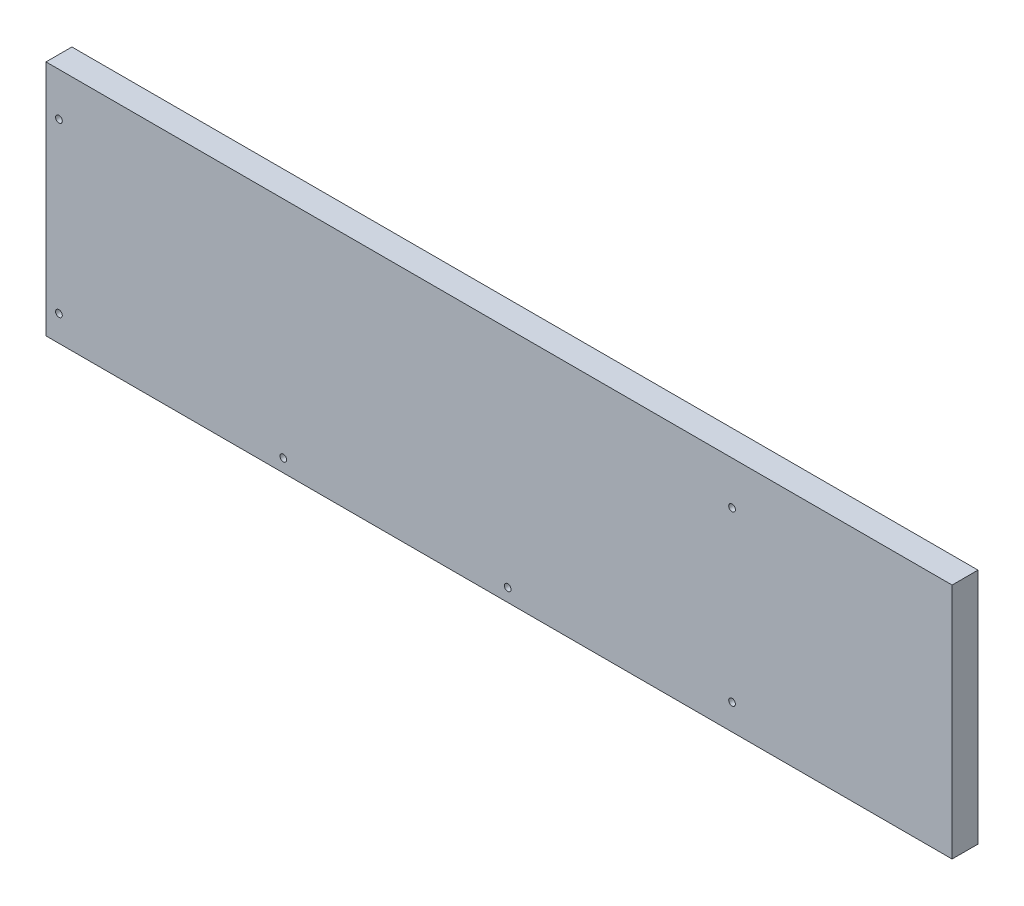
ISO-10303-21;
HEADER;
FILE_DESCRIPTION(('STEP AP214'),'2;1');
FILE_NAME('part.step','',(''),(''),'','','');
FILE_SCHEMA(('AUTOMOTIVE_DESIGN { 1 0 10303 214 1 1 1 1 }'));
ENDSEC;
DATA;
#1=APPLICATION_CONTEXT('core data for automotive mechanical design processes');
#2=APPLICATION_PROTOCOL_DEFINITION('international standard','automotive_design',2000,#1);
#3=PRODUCT_CONTEXT('',#1,'mechanical');
#4=PRODUCT('Part','Part','',(#3));
#5=PRODUCT_RELATED_PRODUCT_CATEGORY('part','',(#4));
#6=PRODUCT_DEFINITION_FORMATION('','',#4);
#7=PRODUCT_DEFINITION_CONTEXT('part definition',#1,'design');
#8=PRODUCT_DEFINITION('design','',#6,#7);
#9=PRODUCT_DEFINITION_SHAPE('','',#8);
#10=(LENGTH_UNIT() NAMED_UNIT(*) SI_UNIT(.MILLI.,.METRE.));
#11=(NAMED_UNIT(*) PLANE_ANGLE_UNIT() SI_UNIT($,.RADIAN.));
#12=(NAMED_UNIT(*) SI_UNIT($,.STERADIAN.) SOLID_ANGLE_UNIT());
#13=UNCERTAINTY_MEASURE_WITH_UNIT(LENGTH_MEASURE(1.E-05),#10,'distance_accuracy_value','');
#14=(GEOMETRIC_REPRESENTATION_CONTEXT(3) GLOBAL_UNCERTAINTY_ASSIGNED_CONTEXT((#13)) GLOBAL_UNIT_ASSIGNED_CONTEXT((#10,
#11,#12)) REPRESENTATION_CONTEXT('',''));
#15=CARTESIAN_POINT('',(0.,0.,0.));
#16=DIRECTION('',(0.,0.,1.));
#17=DIRECTION('',(1.,0.,0.));
#18=AXIS2_PLACEMENT_3D('',#15,#16,#17);
#19=CARTESIAN_POINT('',(210.,55.,12.));
#20=DIRECTION('',(-1.,0.,0.));
#21=DIRECTION('',(0.,0.,1.));
#22=AXIS2_PLACEMENT_3D('',#19,#20,#21);
#23=PLANE('',#22);
#24=DIRECTION('',(0.,1.,0.));
#25=VECTOR('',#24,1.);
#26=CARTESIAN_POINT('',(210.,55.,0.));
#27=LINE('',#26,#25);
#28=CARTESIAN_POINT('',(210.,-55.,0.));
#29=VERTEX_POINT('',#28);
#30=CARTESIAN_POINT('',(210.,55.,0.));
#31=VERTEX_POINT('',#30);
#32=EDGE_CURVE('E96',#29,#31,#27,.T.);
#33=ORIENTED_EDGE('',*,*,#32,.T.);
#34=DIRECTION('',(0.,0.,-1.));
#35=VECTOR('',#34,1.);
#36=CARTESIAN_POINT('',(210.,55.,12.));
#37=LINE('',#36,#35);
#38=CARTESIAN_POINT('',(210.,55.,12.));
#39=VERTEX_POINT('',#38);
#40=EDGE_CURVE('E11',#39,#31,#37,.T.);
#41=ORIENTED_EDGE('',*,*,#40,.F.);
#42=DIRECTION('',(0.,1.,0.));
#43=VECTOR('',#42,1.);
#44=CARTESIAN_POINT('',(210.,55.,12.));
#45=LINE('',#44,#43);
#46=CARTESIAN_POINT('',(210.,-55.,12.));
#47=VERTEX_POINT('',#46);
#48=EDGE_CURVE('E84',#47,#39,#45,.T.);
#49=ORIENTED_EDGE('',*,*,#48,.F.);
#50=DIRECTION('',(0.,0.,-1.));
#51=VECTOR('',#50,1.);
#52=CARTESIAN_POINT('',(210.,-55.,12.));
#53=LINE('',#52,#51);
#54=EDGE_CURVE('E92',#47,#29,#53,.T.);
#55=ORIENTED_EDGE('',*,*,#54,.T.);
#56=EDGE_LOOP('',(#33,#41,#49,#55));
#57=FACE_BOUND('',#56,.T.);
#58=ADVANCED_FACE('F33',(#57),#23,.F.);
#59=CARTESIAN_POINT('',(-210.,55.,12.));
#60=DIRECTION('',(0.,-1.,0.));
#61=DIRECTION('',(0.,0.,-1.));
#62=AXIS2_PLACEMENT_3D('',#59,#60,#61);
#63=PLANE('',#62);
#64=DIRECTION('',(-1.,0.,0.));
#65=VECTOR('',#64,1.);
#66=CARTESIAN_POINT('',(-210.,55.,0.));
#67=LINE('',#66,#65);
#68=CARTESIAN_POINT('',(-210.,55.,0.));
#69=VERTEX_POINT('',#68);
#70=EDGE_CURVE('E88',#31,#69,#67,.T.);
#71=ORIENTED_EDGE('',*,*,#70,.T.);
#72=DIRECTION('',(0.,0.,-1.));
#73=VECTOR('',#72,1.);
#74=CARTESIAN_POINT('',(-210.,55.,12.));
#75=LINE('',#74,#73);
#76=CARTESIAN_POINT('',(-210.,55.,12.));
#77=VERTEX_POINT('',#76);
#78=EDGE_CURVE('E41',#77,#69,#75,.T.);
#79=ORIENTED_EDGE('',*,*,#78,.F.);
#80=DIRECTION('',(-1.,0.,0.));
#81=VECTOR('',#80,1.);
#82=CARTESIAN_POINT('',(-210.,55.,12.));
#83=LINE('',#82,#81);
#84=EDGE_CURVE('E79',#39,#77,#83,.T.);
#85=ORIENTED_EDGE('',*,*,#84,.F.);
#86=ORIENTED_EDGE('',*,*,#40,.T.);
#87=EDGE_LOOP('',(#71,#79,#85,#86));
#88=FACE_BOUND('',#87,.T.);
#89=ADVANCED_FACE('F87',(#88),#63,.F.);
#90=CARTESIAN_POINT('',(-210.,55.,12.));
#91=DIRECTION('',(1.,0.,0.));
#92=DIRECTION('',(0.,0.,-1.));
#93=AXIS2_PLACEMENT_3D('',#90,#91,#92);
#94=PLANE('',#93);
#95=DIRECTION('',(0.,-1.,0.));
#96=VECTOR('',#95,1.);
#97=CARTESIAN_POINT('',(-210.,55.,0.));
#98=LINE('',#97,#96);
#99=CARTESIAN_POINT('',(-210.,-55.,0.));
#100=VERTEX_POINT('',#99);
#101=EDGE_CURVE('E66',#69,#100,#98,.T.);
#102=ORIENTED_EDGE('',*,*,#101,.T.);
#103=DIRECTION('',(0.,0.,-1.));
#104=VECTOR('',#103,1.);
#105=CARTESIAN_POINT('',(-210.,-55.,12.));
#106=LINE('',#105,#104);
#107=CARTESIAN_POINT('',(-210.,-55.,12.));
#108=VERTEX_POINT('',#107);
#109=EDGE_CURVE('E89',#108,#100,#106,.T.);
#110=ORIENTED_EDGE('',*,*,#109,.F.);
#111=DIRECTION('',(0.,-1.,0.));
#112=VECTOR('',#111,1.);
#113=CARTESIAN_POINT('',(-210.,55.,12.));
#114=LINE('',#113,#112);
#115=EDGE_CURVE('E82',#77,#108,#114,.T.);
#116=ORIENTED_EDGE('',*,*,#115,.F.);
#117=ORIENTED_EDGE('',*,*,#78,.T.);
#118=EDGE_LOOP('',(#102,#110,#116,#117));
#119=FACE_BOUND('',#118,.T.);
#120=ADVANCED_FACE('F90',(#119),#94,.F.);
#121=CARTESIAN_POINT('',(-210.,-55.,12.));
#122=DIRECTION('',(0.,1.,0.));
#123=DIRECTION('',(0.,0.,1.));
#124=AXIS2_PLACEMENT_3D('',#121,#122,#123);
#125=PLANE('',#124);
#126=DIRECTION('',(1.,0.,0.));
#127=VECTOR('',#126,1.);
#128=CARTESIAN_POINT('',(-210.,-55.,0.));
#129=LINE('',#128,#127);
#130=EDGE_CURVE('E72',#100,#29,#129,.T.);
#131=ORIENTED_EDGE('',*,*,#130,.T.);
#132=ORIENTED_EDGE('',*,*,#54,.F.);
#133=DIRECTION('',(1.,0.,0.));
#134=VECTOR('',#133,1.);
#135=CARTESIAN_POINT('',(-210.,-55.,12.));
#136=LINE('',#135,#134);
#137=EDGE_CURVE('E49',#108,#47,#136,.T.);
#138=ORIENTED_EDGE('',*,*,#137,.F.);
#139=ORIENTED_EDGE('',*,*,#109,.T.);
#140=EDGE_LOOP('',(#131,#132,#138,#139));
#141=FACE_BOUND('',#140,.T.);
#142=ADVANCED_FACE('F104',(#141),#125,.F.);
#143=CARTESIAN_POINT('',(0.,0.,12.));
#144=DIRECTION('',(0.,0.,1.));
#145=DIRECTION('',(1.,0.,0.));
#146=AXIS2_PLACEMENT_3D('',#143,#144,#145);
#147=PLANE('',#146);
#148=CARTESIAN_POINT('',(108.,35.,12.));
#149=DIRECTION('',(0.,0.,1.));
#150=DIRECTION('',(1.,0.,0.));
#151=AXIS2_PLACEMENT_3D('',#148,#149,#150);
#152=CIRCLE('',#151,1.54999999999999);
#153=CARTESIAN_POINT('',(109.55,35.,12.));
#154=VERTEX_POINT('',#153);
#155=EDGE_CURVE('E140',#154,#154,#152,.T.);
#156=ORIENTED_EDGE('',*,*,#155,.F.);
#157=EDGE_LOOP('',(#156));
#158=FACE_BOUND('',#157,.T.);
#159=CARTESIAN_POINT('',(108.,-43.,12.));
#160=DIRECTION('',(0.,0.,1.));
#161=DIRECTION('',(1.,0.,0.));
#162=AXIS2_PLACEMENT_3D('',#159,#160,#161);
#163=CIRCLE('',#162,1.54999999999999);
#164=CARTESIAN_POINT('',(109.55,-43.,12.));
#165=VERTEX_POINT('',#164);
#166=EDGE_CURVE('E134',#165,#165,#163,.T.);
#167=ORIENTED_EDGE('',*,*,#166,.F.);
#168=EDGE_LOOP('',(#167));
#169=FACE_BOUND('',#168,.T.);
#170=CARTESIAN_POINT('',(3.99999999999998,-49.,12.));
#171=DIRECTION('',(0.,0.,1.));
#172=DIRECTION('',(1.,0.,0.));
#173=AXIS2_PLACEMENT_3D('',#170,#171,#172);
#174=CIRCLE('',#173,1.54999999999999);
#175=CARTESIAN_POINT('',(5.54999999999997,-49.,12.));
#176=VERTEX_POINT('',#175);
#177=EDGE_CURVE('E128',#176,#176,#174,.T.);
#178=ORIENTED_EDGE('',*,*,#177,.F.);
#179=EDGE_LOOP('',(#178));
#180=FACE_BOUND('',#179,.T.);
#181=CARTESIAN_POINT('',(-100.,-49.,12.));
#182=DIRECTION('',(0.,0.,1.));
#183=DIRECTION('',(1.,0.,0.));
#184=AXIS2_PLACEMENT_3D('',#181,#182,#183);
#185=CIRCLE('',#184,1.54999999999999);
#186=CARTESIAN_POINT('',(-98.45,-49.,12.));
#187=VERTEX_POINT('',#186);
#188=EDGE_CURVE('E122',#187,#187,#185,.T.);
#189=ORIENTED_EDGE('',*,*,#188,.F.);
#190=EDGE_LOOP('',(#189));
#191=FACE_BOUND('',#190,.T.);
#192=CARTESIAN_POINT('',(-204.,-43.,12.));
#193=DIRECTION('',(0.,0.,1.));
#194=DIRECTION('',(1.,0.,0.));
#195=AXIS2_PLACEMENT_3D('',#192,#193,#194);
#196=CIRCLE('',#195,1.54999999999999);
#197=CARTESIAN_POINT('',(-202.45,-43.,12.));
#198=VERTEX_POINT('',#197);
#199=EDGE_CURVE('E116',#198,#198,#196,.T.);
#200=ORIENTED_EDGE('',*,*,#199,.F.);
#201=EDGE_LOOP('',(#200));
#202=FACE_BOUND('',#201,.T.);
#203=CARTESIAN_POINT('',(-204.,35.,12.));
#204=DIRECTION('',(0.,0.,1.));
#205=DIRECTION('',(1.,0.,0.));
#206=AXIS2_PLACEMENT_3D('',#203,#204,#205);
#207=CIRCLE('',#206,1.54999999999999);
#208=CARTESIAN_POINT('',(-202.45,35.,12.));
#209=VERTEX_POINT('',#208);
#210=EDGE_CURVE('E110',#209,#209,#207,.T.);
#211=ORIENTED_EDGE('',*,*,#210,.F.);
#212=EDGE_LOOP('',(#211));
#213=FACE_BOUND('',#212,.T.);
#214=ORIENTED_EDGE('',*,*,#48,.T.);
#215=ORIENTED_EDGE('',*,*,#84,.T.);
#216=ORIENTED_EDGE('',*,*,#115,.T.);
#217=ORIENTED_EDGE('',*,*,#137,.T.);
#218=EDGE_LOOP('',(#214,#215,#216,#217));
#219=FACE_BOUND('',#218,.T.);
#220=ADVANCED_FACE('F80',(#158,#169,#180,#191,#202,#213,#219),#147,.T.);
#221=CARTESIAN_POINT('',(0.,0.,0.));
#222=DIRECTION('',(0.,0.,1.));
#223=DIRECTION('',(1.,0.,0.));
#224=AXIS2_PLACEMENT_3D('',#221,#222,#223);
#225=PLANE('',#224);
#226=CARTESIAN_POINT('',(108.,35.,0.));
#227=DIRECTION('',(0.,0.,1.));
#228=DIRECTION('',(1.,0.,0.));
#229=AXIS2_PLACEMENT_3D('',#226,#227,#228);
#230=CIRCLE('',#229,1.54999999999999);
#231=CARTESIAN_POINT('',(109.55,35.,0.));
#232=VERTEX_POINT('',#231);
#233=EDGE_CURVE('E137',#232,#232,#230,.T.);
#234=ORIENTED_EDGE('',*,*,#233,.T.);
#235=EDGE_LOOP('',(#234));
#236=FACE_BOUND('',#235,.T.);
#237=CARTESIAN_POINT('',(108.,-43.,0.));
#238=DIRECTION('',(0.,0.,1.));
#239=DIRECTION('',(1.,0.,0.));
#240=AXIS2_PLACEMENT_3D('',#237,#238,#239);
#241=CIRCLE('',#240,1.54999999999999);
#242=CARTESIAN_POINT('',(109.55,-43.,0.));
#243=VERTEX_POINT('',#242);
#244=EDGE_CURVE('E131',#243,#243,#241,.T.);
#245=ORIENTED_EDGE('',*,*,#244,.T.);
#246=EDGE_LOOP('',(#245));
#247=FACE_BOUND('',#246,.T.);
#248=CARTESIAN_POINT('',(3.99999999999998,-49.,0.));
#249=DIRECTION('',(0.,0.,1.));
#250=DIRECTION('',(1.,0.,0.));
#251=AXIS2_PLACEMENT_3D('',#248,#249,#250);
#252=CIRCLE('',#251,1.54999999999999);
#253=CARTESIAN_POINT('',(5.54999999999997,-49.,0.));
#254=VERTEX_POINT('',#253);
#255=EDGE_CURVE('E125',#254,#254,#252,.T.);
#256=ORIENTED_EDGE('',*,*,#255,.T.);
#257=EDGE_LOOP('',(#256));
#258=FACE_BOUND('',#257,.T.);
#259=CARTESIAN_POINT('',(-100.,-49.,0.));
#260=DIRECTION('',(0.,0.,1.));
#261=DIRECTION('',(1.,0.,0.));
#262=AXIS2_PLACEMENT_3D('',#259,#260,#261);
#263=CIRCLE('',#262,1.54999999999999);
#264=CARTESIAN_POINT('',(-98.45,-49.,0.));
#265=VERTEX_POINT('',#264);
#266=EDGE_CURVE('E119',#265,#265,#263,.T.);
#267=ORIENTED_EDGE('',*,*,#266,.T.);
#268=EDGE_LOOP('',(#267));
#269=FACE_BOUND('',#268,.T.);
#270=CARTESIAN_POINT('',(-204.,-43.,0.));
#271=DIRECTION('',(0.,0.,1.));
#272=DIRECTION('',(1.,0.,0.));
#273=AXIS2_PLACEMENT_3D('',#270,#271,#272);
#274=CIRCLE('',#273,1.54999999999999);
#275=CARTESIAN_POINT('',(-202.45,-43.,0.));
#276=VERTEX_POINT('',#275);
#277=EDGE_CURVE('E113',#276,#276,#274,.T.);
#278=ORIENTED_EDGE('',*,*,#277,.T.);
#279=EDGE_LOOP('',(#278));
#280=FACE_BOUND('',#279,.T.);
#281=CARTESIAN_POINT('',(-204.,35.,0.));
#282=DIRECTION('',(0.,0.,1.));
#283=DIRECTION('',(1.,0.,0.));
#284=AXIS2_PLACEMENT_3D('',#281,#282,#283);
#285=CIRCLE('',#284,1.54999999999999);
#286=CARTESIAN_POINT('',(-202.45,35.,0.));
#287=VERTEX_POINT('',#286);
#288=EDGE_CURVE('E99',#287,#287,#285,.T.);
#289=ORIENTED_EDGE('',*,*,#288,.T.);
#290=EDGE_LOOP('',(#289));
#291=FACE_BOUND('',#290,.T.);
#292=ORIENTED_EDGE('',*,*,#32,.F.);
#293=ORIENTED_EDGE('',*,*,#130,.F.);
#294=ORIENTED_EDGE('',*,*,#101,.F.);
#295=ORIENTED_EDGE('',*,*,#70,.F.);
#296=EDGE_LOOP('',(#292,#293,#294,#295));
#297=FACE_BOUND('',#296,.T.);
#298=ADVANCED_FACE('F107',(#236,#247,#258,#269,#280,#291,#297),#225,.F.);
#299=CARTESIAN_POINT('',(-204.,35.,0.));
#300=DIRECTION('',(0.,0.,1.));
#301=DIRECTION('',(1.,0.,0.));
#302=AXIS2_PLACEMENT_3D('',#299,#300,#301);
#303=CYLINDRICAL_SURFACE('',#302,1.54999999999999);
#304=ORIENTED_EDGE('',*,*,#288,.F.);
#305=EDGE_LOOP('',(#304));
#306=FACE_BOUND('',#305,.T.);
#307=ORIENTED_EDGE('',*,*,#210,.T.);
#308=EDGE_LOOP('',(#307));
#309=FACE_BOUND('',#308,.T.);
#310=ADVANCED_FACE('F168',(#306,#309),#303,.F.);
#311=CARTESIAN_POINT('',(-204.,-43.,0.));
#312=DIRECTION('',(0.,0.,1.));
#313=DIRECTION('',(1.,0.,0.));
#314=AXIS2_PLACEMENT_3D('',#311,#312,#313);
#315=CYLINDRICAL_SURFACE('',#314,1.54999999999999);
#316=ORIENTED_EDGE('',*,*,#277,.F.);
#317=EDGE_LOOP('',(#316));
#318=FACE_BOUND('',#317,.T.);
#319=ORIENTED_EDGE('',*,*,#199,.T.);
#320=EDGE_LOOP('',(#319));
#321=FACE_BOUND('',#320,.T.);
#322=ADVANCED_FACE('F170',(#318,#321),#315,.F.);
#323=CARTESIAN_POINT('',(-100.,-49.,0.));
#324=DIRECTION('',(0.,0.,1.));
#325=DIRECTION('',(1.,0.,0.));
#326=AXIS2_PLACEMENT_3D('',#323,#324,#325);
#327=CYLINDRICAL_SURFACE('',#326,1.54999999999999);
#328=ORIENTED_EDGE('',*,*,#266,.F.);
#329=EDGE_LOOP('',(#328));
#330=FACE_BOUND('',#329,.T.);
#331=ORIENTED_EDGE('',*,*,#188,.T.);
#332=EDGE_LOOP('',(#331));
#333=FACE_BOUND('',#332,.T.);
#334=ADVANCED_FACE('F177',(#330,#333),#327,.F.);
#335=CARTESIAN_POINT('',(3.99999999999998,-49.,0.));
#336=DIRECTION('',(0.,0.,1.));
#337=DIRECTION('',(1.,0.,0.));
#338=AXIS2_PLACEMENT_3D('',#335,#336,#337);
#339=CYLINDRICAL_SURFACE('',#338,1.54999999999999);
#340=ORIENTED_EDGE('',*,*,#255,.F.);
#341=EDGE_LOOP('',(#340));
#342=FACE_BOUND('',#341,.T.);
#343=ORIENTED_EDGE('',*,*,#177,.T.);
#344=EDGE_LOOP('',(#343));
#345=FACE_BOUND('',#344,.T.);
#346=ADVANCED_FACE('F225',(#342,#345),#339,.F.);
#347=CARTESIAN_POINT('',(108.,-43.,0.));
#348=DIRECTION('',(0.,0.,1.));
#349=DIRECTION('',(1.,0.,0.));
#350=AXIS2_PLACEMENT_3D('',#347,#348,#349);
#351=CYLINDRICAL_SURFACE('',#350,1.54999999999999);
#352=ORIENTED_EDGE('',*,*,#244,.F.);
#353=EDGE_LOOP('',(#352));
#354=FACE_BOUND('',#353,.T.);
#355=ORIENTED_EDGE('',*,*,#166,.T.);
#356=EDGE_LOOP('',(#355));
#357=FACE_BOUND('',#356,.T.);
#358=ADVANCED_FACE('F151',(#354,#357),#351,.F.);
#359=CARTESIAN_POINT('',(108.,35.,0.));
#360=DIRECTION('',(0.,0.,1.));
#361=DIRECTION('',(1.,0.,0.));
#362=AXIS2_PLACEMENT_3D('',#359,#360,#361);
#363=CYLINDRICAL_SURFACE('',#362,1.54999999999999);
#364=ORIENTED_EDGE('',*,*,#233,.F.);
#365=EDGE_LOOP('',(#364));
#366=FACE_BOUND('',#365,.T.);
#367=ORIENTED_EDGE('',*,*,#155,.T.);
#368=EDGE_LOOP('',(#367));
#369=FACE_BOUND('',#368,.T.);
#370=ADVANCED_FACE('F148',(#366,#369),#363,.F.);
#371=CLOSED_SHELL('',(#58,#89,#120,#142,#220,#298,#310,#322,#334,#346,#358,#370));
#372=MANIFOLD_SOLID_BREP('B2',#371);
#373=ADVANCED_BREP_SHAPE_REPRESENTATION('',(#18,#372),#14);
#374=SHAPE_DEFINITION_REPRESENTATION(#9,#373);
ENDSEC;
END-ISO-10303-21;
